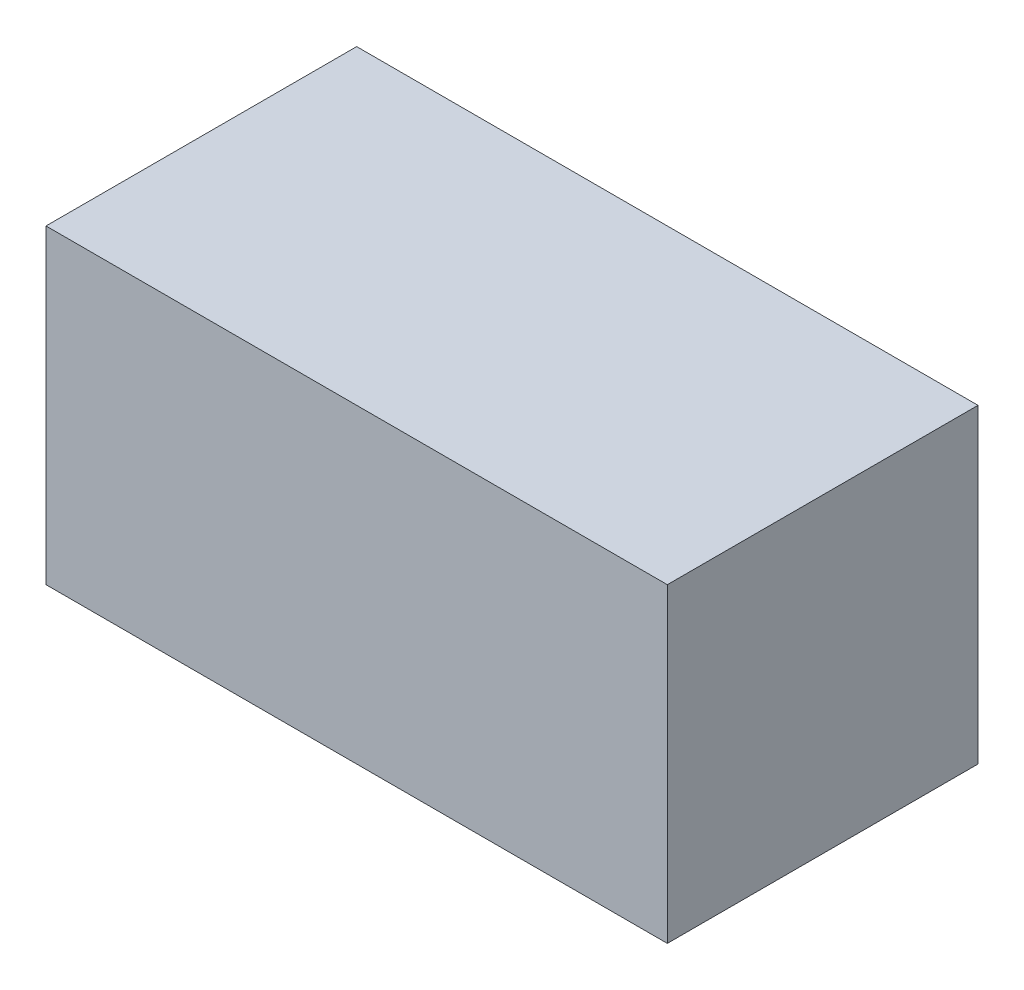
ISO-10303-21;
HEADER;
FILE_DESCRIPTION(('STEP AP214'),'2;1');
FILE_NAME('part.step','',(''),(''),'','','');
FILE_SCHEMA(('AUTOMOTIVE_DESIGN { 1 0 10303 214 1 1 1 1 }'));
ENDSEC;
DATA;
#1=APPLICATION_CONTEXT('core data for automotive mechanical design processes');
#2=APPLICATION_PROTOCOL_DEFINITION('international standard','automotive_design',2000,#1);
#3=PRODUCT_CONTEXT('',#1,'mechanical');
#4=PRODUCT('Part','Part','',(#3));
#5=PRODUCT_RELATED_PRODUCT_CATEGORY('part','',(#4));
#6=PRODUCT_DEFINITION_FORMATION('','',#4);
#7=PRODUCT_DEFINITION_CONTEXT('part definition',#1,'design');
#8=PRODUCT_DEFINITION('design','',#6,#7);
#9=PRODUCT_DEFINITION_SHAPE('','',#8);
#10=(LENGTH_UNIT() NAMED_UNIT(*) SI_UNIT(.MILLI.,.METRE.));
#11=(NAMED_UNIT(*) PLANE_ANGLE_UNIT() SI_UNIT($,.RADIAN.));
#12=(NAMED_UNIT(*) SI_UNIT($,.STERADIAN.) SOLID_ANGLE_UNIT());
#13=UNCERTAINTY_MEASURE_WITH_UNIT(LENGTH_MEASURE(1.E-05),#10,'distance_accuracy_value','');
#14=(GEOMETRIC_REPRESENTATION_CONTEXT(3) GLOBAL_UNCERTAINTY_ASSIGNED_CONTEXT((#13)) GLOBAL_UNIT_ASSIGNED_CONTEXT((#10,
#11,#12)) REPRESENTATION_CONTEXT('',''));
#15=CARTESIAN_POINT('',(0.,0.,0.));
#16=DIRECTION('',(0.,0.,1.));
#17=DIRECTION('',(1.,0.,0.));
#18=AXIS2_PLACEMENT_3D('',#15,#16,#17);
#19=CARTESIAN_POINT('',(-20.,20.,-10.));
#20=DIRECTION('',(1.,0.,0.));
#21=DIRECTION('',(0.,0.,-1.));
#22=AXIS2_PLACEMENT_3D('',#19,#20,#21);
#23=PLANE('',#22);
#24=DIRECTION('',(0.,0.,1.));
#25=VECTOR('',#24,1.);
#26=CARTESIAN_POINT('',(-20.,0.,-10.));
#27=LINE('',#26,#25);
#28=CARTESIAN_POINT('',(-20.,0.,-10.));
#29=VERTEX_POINT('',#28);
#30=CARTESIAN_POINT('',(-20.,0.,10.));
#31=VERTEX_POINT('',#30);
#32=EDGE_CURVE('E95',#29,#31,#27,.T.);
#33=ORIENTED_EDGE('',*,*,#32,.T.);
#34=DIRECTION('',(0.,-1.,0.));
#35=VECTOR('',#34,1.);
#36=CARTESIAN_POINT('',(-20.,20.,10.));
#37=LINE('',#36,#35);
#38=CARTESIAN_POINT('',(-20.,20.,10.));
#39=VERTEX_POINT('',#38);
#40=EDGE_CURVE('E11',#39,#31,#37,.T.);
#41=ORIENTED_EDGE('',*,*,#40,.F.);
#42=DIRECTION('',(0.,0.,1.));
#43=VECTOR('',#42,1.);
#44=CARTESIAN_POINT('',(-20.,20.,-10.));
#45=LINE('',#44,#43);
#46=CARTESIAN_POINT('',(-20.,20.,-10.));
#47=VERTEX_POINT('',#46);
#48=EDGE_CURVE('E83',#47,#39,#45,.T.);
#49=ORIENTED_EDGE('',*,*,#48,.F.);
#50=DIRECTION('',(0.,-1.,0.));
#51=VECTOR('',#50,1.);
#52=CARTESIAN_POINT('',(-20.,20.,-10.));
#53=LINE('',#52,#51);
#54=EDGE_CURVE('E91',#47,#29,#53,.T.);
#55=ORIENTED_EDGE('',*,*,#54,.T.);
#56=EDGE_LOOP('',(#33,#41,#49,#55));
#57=FACE_BOUND('',#56,.T.);
#58=ADVANCED_FACE('F32',(#57),#23,.F.);
#59=CARTESIAN_POINT('',(-20.,20.,10.));
#60=DIRECTION('',(0.,0.,-1.));
#61=DIRECTION('',(-1.,0.,0.));
#62=AXIS2_PLACEMENT_3D('',#59,#60,#61);
#63=PLANE('',#62);
#64=DIRECTION('',(1.,0.,0.));
#65=VECTOR('',#64,1.);
#66=CARTESIAN_POINT('',(-20.,0.,10.));
#67=LINE('',#66,#65);
#68=CARTESIAN_POINT('',(20.,0.,10.));
#69=VERTEX_POINT('',#68);
#70=EDGE_CURVE('E87',#31,#69,#67,.T.);
#71=ORIENTED_EDGE('',*,*,#70,.T.);
#72=DIRECTION('',(0.,-1.,0.));
#73=VECTOR('',#72,1.);
#74=CARTESIAN_POINT('',(20.,20.,10.));
#75=LINE('',#74,#73);
#76=CARTESIAN_POINT('',(20.,20.,10.));
#77=VERTEX_POINT('',#76);
#78=EDGE_CURVE('E40',#77,#69,#75,.T.);
#79=ORIENTED_EDGE('',*,*,#78,.F.);
#80=DIRECTION('',(1.,0.,0.));
#81=VECTOR('',#80,1.);
#82=CARTESIAN_POINT('',(-20.,20.,10.));
#83=LINE('',#82,#81);
#84=EDGE_CURVE('E78',#39,#77,#83,.T.);
#85=ORIENTED_EDGE('',*,*,#84,.F.);
#86=ORIENTED_EDGE('',*,*,#40,.T.);
#87=EDGE_LOOP('',(#71,#79,#85,#86));
#88=FACE_BOUND('',#87,.T.);
#89=ADVANCED_FACE('F86',(#88),#63,.F.);
#90=CARTESIAN_POINT('',(20.,20.,-10.));
#91=DIRECTION('',(-1.,0.,0.));
#92=DIRECTION('',(0.,0.,1.));
#93=AXIS2_PLACEMENT_3D('',#90,#91,#92);
#94=PLANE('',#93);
#95=DIRECTION('',(0.,0.,-1.));
#96=VECTOR('',#95,1.);
#97=CARTESIAN_POINT('',(20.,0.,-10.));
#98=LINE('',#97,#96);
#99=CARTESIAN_POINT('',(20.,0.,-10.));
#100=VERTEX_POINT('',#99);
#101=EDGE_CURVE('E65',#69,#100,#98,.T.);
#102=ORIENTED_EDGE('',*,*,#101,.T.);
#103=DIRECTION('',(0.,-1.,0.));
#104=VECTOR('',#103,1.);
#105=CARTESIAN_POINT('',(20.,20.,-10.));
#106=LINE('',#105,#104);
#107=CARTESIAN_POINT('',(20.,20.,-10.));
#108=VERTEX_POINT('',#107);
#109=EDGE_CURVE('E88',#108,#100,#106,.T.);
#110=ORIENTED_EDGE('',*,*,#109,.F.);
#111=DIRECTION('',(0.,0.,-1.));
#112=VECTOR('',#111,1.);
#113=CARTESIAN_POINT('',(20.,20.,-10.));
#114=LINE('',#113,#112);
#115=EDGE_CURVE('E81',#77,#108,#114,.T.);
#116=ORIENTED_EDGE('',*,*,#115,.F.);
#117=ORIENTED_EDGE('',*,*,#78,.T.);
#118=EDGE_LOOP('',(#102,#110,#116,#117));
#119=FACE_BOUND('',#118,.T.);
#120=ADVANCED_FACE('F89',(#119),#94,.F.);
#121=CARTESIAN_POINT('',(-20.,20.,-10.));
#122=DIRECTION('',(0.,0.,1.));
#123=DIRECTION('',(1.,0.,0.));
#124=AXIS2_PLACEMENT_3D('',#121,#122,#123);
#125=PLANE('',#124);
#126=DIRECTION('',(-1.,0.,0.));
#127=VECTOR('',#126,1.);
#128=CARTESIAN_POINT('',(-20.,0.,-10.));
#129=LINE('',#128,#127);
#130=EDGE_CURVE('E71',#100,#29,#129,.T.);
#131=ORIENTED_EDGE('',*,*,#130,.T.);
#132=ORIENTED_EDGE('',*,*,#54,.F.);
#133=DIRECTION('',(-1.,0.,0.));
#134=VECTOR('',#133,1.);
#135=CARTESIAN_POINT('',(-20.,20.,-10.));
#136=LINE('',#135,#134);
#137=EDGE_CURVE('E48',#108,#47,#136,.T.);
#138=ORIENTED_EDGE('',*,*,#137,.F.);
#139=ORIENTED_EDGE('',*,*,#109,.T.);
#140=EDGE_LOOP('',(#131,#132,#138,#139));
#141=FACE_BOUND('',#140,.T.);
#142=ADVANCED_FACE('F102',(#141),#125,.F.);
#143=CARTESIAN_POINT('',(0.,20.,0.));
#144=DIRECTION('',(0.,1.,0.));
#145=DIRECTION('',(0.,0.,1.));
#146=AXIS2_PLACEMENT_3D('',#143,#144,#145);
#147=PLANE('',#146);
#148=ORIENTED_EDGE('',*,*,#48,.T.);
#149=ORIENTED_EDGE('',*,*,#84,.T.);
#150=ORIENTED_EDGE('',*,*,#115,.T.);
#151=ORIENTED_EDGE('',*,*,#137,.T.);
#152=EDGE_LOOP('',(#148,#149,#150,#151));
#153=FACE_BOUND('',#152,.T.);
#154=ADVANCED_FACE('F79',(#153),#147,.T.);
#155=CARTESIAN_POINT('',(0.,0.,0.));
#156=DIRECTION('',(0.,1.,0.));
#157=DIRECTION('',(0.,0.,1.));
#158=AXIS2_PLACEMENT_3D('',#155,#156,#157);
#159=PLANE('',#158);
#160=ORIENTED_EDGE('',*,*,#32,.F.);
#161=ORIENTED_EDGE('',*,*,#130,.F.);
#162=ORIENTED_EDGE('',*,*,#101,.F.);
#163=ORIENTED_EDGE('',*,*,#70,.F.);
#164=EDGE_LOOP('',(#160,#161,#162,#163));
#165=FACE_BOUND('',#164,.T.);
#166=ADVANCED_FACE('F105',(#165),#159,.F.);
#167=CLOSED_SHELL('',(#58,#89,#120,#142,#154,#166));
#168=MANIFOLD_SOLID_BREP('B2',#167);
#169=ADVANCED_BREP_SHAPE_REPRESENTATION('',(#18,#168),#14);
#170=SHAPE_DEFINITION_REPRESENTATION(#9,#169);
ENDSEC;
END-ISO-10303-21;
